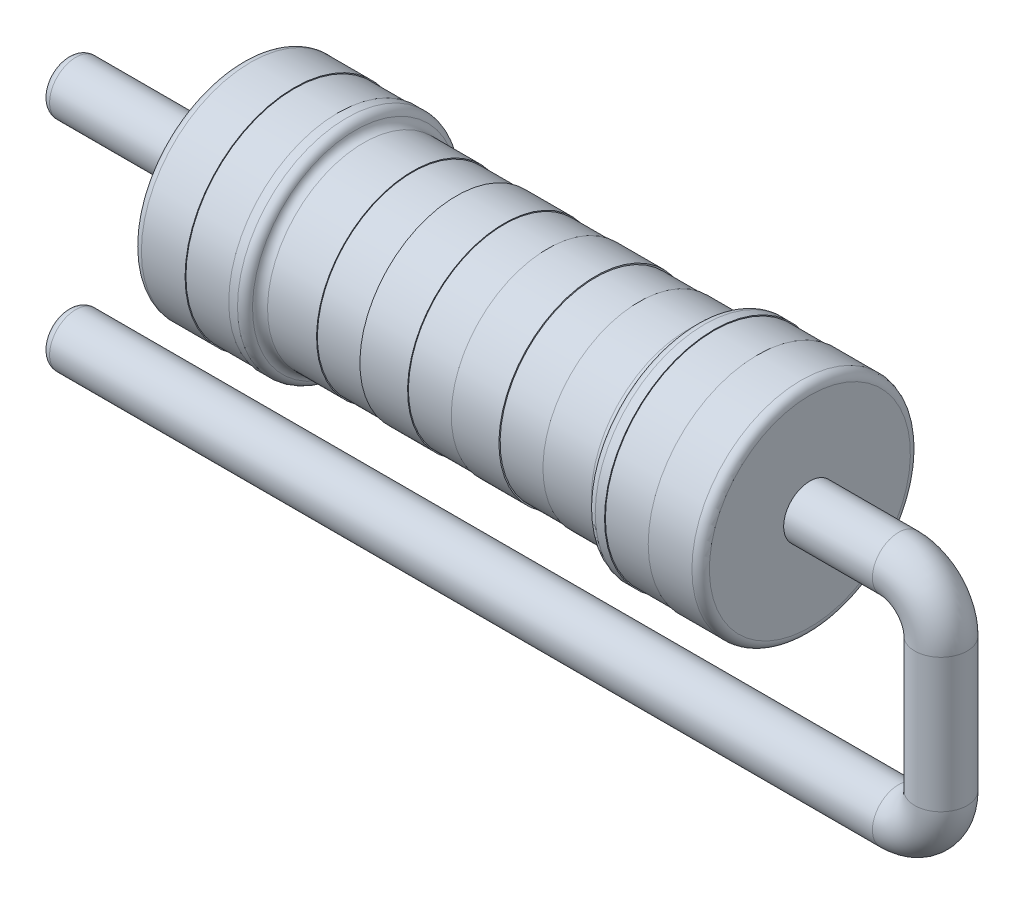
ISO-10303-21;
HEADER;
FILE_DESCRIPTION(('STEP AP214'),'2;1');
FILE_NAME('part.step','',(''),(''),'','','');
FILE_SCHEMA(('AUTOMOTIVE_DESIGN { 1 0 10303 214 1 1 1 1 }'));
ENDSEC;
DATA;
#1=APPLICATION_CONTEXT('core data for automotive mechanical design processes');
#2=APPLICATION_PROTOCOL_DEFINITION('international standard','automotive_design',2000,#1);
#3=PRODUCT_CONTEXT('',#1,'mechanical');
#4=PRODUCT('Part','Part','',(#3));
#5=PRODUCT_RELATED_PRODUCT_CATEGORY('part','',(#4));
#6=PRODUCT_DEFINITION_FORMATION('','',#4);
#7=PRODUCT_DEFINITION_CONTEXT('part definition',#1,'design');
#8=PRODUCT_DEFINITION('design','',#6,#7);
#9=PRODUCT_DEFINITION_SHAPE('','',#8);
#10=(LENGTH_UNIT() NAMED_UNIT(*) SI_UNIT(.MILLI.,.METRE.));
#11=(NAMED_UNIT(*) PLANE_ANGLE_UNIT() SI_UNIT($,.RADIAN.));
#12=(NAMED_UNIT(*) SI_UNIT($,.STERADIAN.) SOLID_ANGLE_UNIT());
#13=UNCERTAINTY_MEASURE_WITH_UNIT(LENGTH_MEASURE(1.E-05),#10,'distance_accuracy_value','');
#14=(GEOMETRIC_REPRESENTATION_CONTEXT(3) GLOBAL_UNCERTAINTY_ASSIGNED_CONTEXT((#13)) GLOBAL_UNIT_ASSIGNED_CONTEXT((#10,
#11,#12)) REPRESENTATION_CONTEXT('',''));
#15=CARTESIAN_POINT('',(0.,0.,0.));
#16=DIRECTION('',(0.,0.,1.));
#17=DIRECTION('',(1.,0.,0.));
#18=AXIS2_PLACEMENT_3D('',#15,#16,#17);
#19=CARTESIAN_POINT('',(3.25,0.,0.));
#20=DIRECTION('',(1.,0.,0.));
#21=DIRECTION('',(0.,1.,0.));
#22=AXIS2_PLACEMENT_3D('',#19,#20,#21);
#23=PLANE('',#22);
#24=CARTESIAN_POINT('',(3.25,0.,0.));
#25=DIRECTION('',(1.,0.,0.));
#26=DIRECTION('',(0.,1.,0.));
#27=AXIS2_PLACEMENT_3D('',#24,#25,#26);
#28=CIRCLE('',#27,0.3);
#29=CARTESIAN_POINT('',(3.25,0.300000000000001,0.));
#30=VERTEX_POINT('',#29);
#31=EDGE_CURVE('E56',#30,#30,#28,.T.);
#32=ORIENTED_EDGE('',*,*,#31,.F.);
#33=EDGE_LOOP('',(#32));
#34=FACE_BOUND('',#33,.T.);
#35=CARTESIAN_POINT('',(3.25,0.,0.));
#36=DIRECTION('',(1.,0.,0.));
#37=DIRECTION('',(0.,1.,0.));
#38=AXIS2_PLACEMENT_3D('',#35,#36,#37);
#39=CIRCLE('',#38,1.15);
#40=CARTESIAN_POINT('',(3.25,1.15,0.));
#41=VERTEX_POINT('',#40);
#42=EDGE_CURVE('E59',#41,#41,#39,.T.);
#43=ORIENTED_EDGE('',*,*,#42,.T.);
#44=EDGE_LOOP('',(#43));
#45=FACE_BOUND('',#44,.T.);
#46=ADVANCED_FACE('F33',(#34,#45),#23,.T.);
#47=CARTESIAN_POINT('',(-3.25,0.,0.));
#48=DIRECTION('',(-1.,0.,0.));
#49=DIRECTION('',(0.,-1.,0.));
#50=AXIS2_PLACEMENT_3D('',#47,#48,#49);
#51=CYLINDRICAL_SURFACE('',#50,1.25);
#52=CARTESIAN_POINT('',(3.15,0.,0.));
#53=DIRECTION('',(1.,0.,0.));
#54=DIRECTION('',(0.,1.,0.));
#55=AXIS2_PLACEMENT_3D('',#52,#53,#54);
#56=CIRCLE('',#55,1.25);
#57=CARTESIAN_POINT('',(3.15,1.25,0.));
#58=VERTEX_POINT('',#57);
#59=EDGE_CURVE('E62',#58,#58,#56,.F.);
#60=ORIENTED_EDGE('',*,*,#59,.T.);
#61=EDGE_LOOP('',(#60));
#62=FACE_BOUND('',#61,.T.);
#63=CARTESIAN_POINT('',(2.65,0.,0.));
#64=DIRECTION('',(-1.,0.,0.));
#65=DIRECTION('',(0.,-1.,0.));
#66=AXIS2_PLACEMENT_3D('',#63,#64,#65);
#67=CIRCLE('',#66,1.25);
#68=CARTESIAN_POINT('',(2.65,-1.25,0.));
#69=VERTEX_POINT('',#68);
#70=EDGE_CURVE('E89',#69,#69,#67,.T.);
#71=ORIENTED_EDGE('',*,*,#70,.F.);
#72=EDGE_LOOP('',(#71));
#73=FACE_BOUND('',#72,.T.);
#74=ADVANCED_FACE('F173',(#62,#73),#51,.T.);
#75=CARTESIAN_POINT('',(2.65,-1.25,0.));
#76=DIRECTION('',(-1.,0.,0.));
#77=DIRECTION('',(0.,-1.,0.));
#78=AXIS2_PLACEMENT_3D('',#75,#76,#77);
#79=PLANE('',#78);
#80=ORIENTED_EDGE('',*,*,#70,.T.);
#81=EDGE_LOOP('',(#80));
#82=FACE_BOUND('',#81,.T.);
#83=CARTESIAN_POINT('',(2.65,0.,0.));
#84=DIRECTION('',(-1.,0.,0.));
#85=DIRECTION('',(0.,-1.,0.));
#86=AXIS2_PLACEMENT_3D('',#83,#84,#85);
#87=CIRCLE('',#86,1.24);
#88=CARTESIAN_POINT('',(2.65,-1.24,0.));
#89=VERTEX_POINT('',#88);
#90=EDGE_CURVE('E92',#89,#89,#87,.T.);
#91=ORIENTED_EDGE('',*,*,#90,.F.);
#92=EDGE_LOOP('',(#91));
#93=FACE_BOUND('',#92,.T.);
#94=ADVANCED_FACE('F187',(#82,#93),#79,.T.);
#95=CARTESIAN_POINT('',(-3.25,0.,0.));
#96=DIRECTION('',(-1.,0.,0.));
#97=DIRECTION('',(0.,-1.,0.));
#98=AXIS2_PLACEMENT_3D('',#95,#96,#97);
#99=CYLINDRICAL_SURFACE('',#98,1.24);
#100=ORIENTED_EDGE('',*,*,#90,.T.);
#101=EDGE_LOOP('',(#100));
#102=FACE_BOUND('',#101,.T.);
#103=CARTESIAN_POINT('',(2.15,0.,0.));
#104=DIRECTION('',(-1.,0.,0.));
#105=DIRECTION('',(0.,-1.,0.));
#106=AXIS2_PLACEMENT_3D('',#103,#104,#105);
#107=CIRCLE('',#106,1.24);
#108=CARTESIAN_POINT('',(2.15,-1.24,0.));
#109=VERTEX_POINT('',#108);
#110=EDGE_CURVE('E95',#109,#109,#107,.T.);
#111=ORIENTED_EDGE('',*,*,#110,.F.);
#112=EDGE_LOOP('',(#111));
#113=FACE_BOUND('',#112,.T.);
#114=ADVANCED_FACE('F193',(#102,#113),#99,.T.);
#115=CARTESIAN_POINT('',(2.15,-1.24,0.));
#116=DIRECTION('',(1.,0.,0.));
#117=DIRECTION('',(0.,1.,0.));
#118=AXIS2_PLACEMENT_3D('',#115,#116,#117);
#119=PLANE('',#118);
#120=ORIENTED_EDGE('',*,*,#110,.T.);
#121=EDGE_LOOP('',(#120));
#122=FACE_BOUND('',#121,.T.);
#123=CARTESIAN_POINT('',(2.15,0.,0.));
#124=DIRECTION('',(-1.,0.,0.));
#125=DIRECTION('',(0.,-1.,0.));
#126=AXIS2_PLACEMENT_3D('',#123,#124,#125);
#127=CIRCLE('',#126,1.25);
#128=CARTESIAN_POINT('',(2.15,-1.25,0.));
#129=VERTEX_POINT('',#128);
#130=EDGE_CURVE('E98',#129,#129,#127,.T.);
#131=ORIENTED_EDGE('',*,*,#130,.F.);
#132=EDGE_LOOP('',(#131));
#133=FACE_BOUND('',#132,.T.);
#134=ADVANCED_FACE('F199',(#122,#133),#119,.T.);
#135=CARTESIAN_POINT('',(-3.25,0.,0.));
#136=DIRECTION('',(-1.,0.,0.));
#137=DIRECTION('',(0.,-1.,0.));
#138=AXIS2_PLACEMENT_3D('',#135,#136,#137);
#139=CYLINDRICAL_SURFACE('',#138,1.25);
#140=CARTESIAN_POINT('',(2.0436491673104,0.,0.));
#141=DIRECTION('',(1.,0.,0.));
#142=DIRECTION('',(0.,1.,0.));
#143=AXIS2_PLACEMENT_3D('',#140,#141,#142);
#144=CIRCLE('',#143,1.25);
#145=CARTESIAN_POINT('',(2.0436491673104,1.25,0.));
#146=VERTEX_POINT('',#145);
#147=EDGE_CURVE('E71',#146,#146,#144,.T.);
#148=ORIENTED_EDGE('',*,*,#147,.T.);
#149=EDGE_LOOP('',(#148));
#150=FACE_BOUND('',#149,.T.);
#151=ORIENTED_EDGE('',*,*,#130,.T.);
#152=EDGE_LOOP('',(#151));
#153=FACE_BOUND('',#152,.T.);
#154=ADVANCED_FACE('F205',(#150,#153),#139,.T.);
#155=CARTESIAN_POINT('',(-3.25,0.,0.));
#156=DIRECTION('',(-1.,0.,0.));
#157=DIRECTION('',(0.,-1.,0.));
#158=AXIS2_PLACEMENT_3D('',#155,#156,#157);
#159=CYLINDRICAL_SURFACE('',#158,1.1);
#160=CARTESIAN_POINT('',(1.85,0.,0.));
#161=DIRECTION('',(-1.,0.,0.));
#162=DIRECTION('',(0.,-1.,0.));
#163=AXIS2_PLACEMENT_3D('',#160,#161,#162);
#164=CIRCLE('',#163,1.1);
#165=CARTESIAN_POINT('',(1.85,-1.1,0.));
#166=VERTEX_POINT('',#165);
#167=EDGE_CURVE('E86',#166,#166,#164,.T.);
#168=ORIENTED_EDGE('',*,*,#167,.T.);
#169=EDGE_LOOP('',(#168));
#170=FACE_BOUND('',#169,.T.);
#171=CARTESIAN_POINT('',(1.29552343653446,0.,0.));
#172=DIRECTION('',(-1.,0.,0.));
#173=DIRECTION('',(0.,-1.,0.));
#174=AXIS2_PLACEMENT_3D('',#171,#172,#173);
#175=CIRCLE('',#174,1.1);
#176=CARTESIAN_POINT('',(1.29552343653446,-1.1,0.));
#177=VERTEX_POINT('',#176);
#178=EDGE_CURVE('E101',#177,#177,#175,.T.);
#179=ORIENTED_EDGE('',*,*,#178,.F.);
#180=EDGE_LOOP('',(#179));
#181=FACE_BOUND('',#180,.T.);
#182=ADVANCED_FACE('F210',(#170,#181),#159,.T.);
#183=CARTESIAN_POINT('',(1.29552343653446,-1.1,0.));
#184=DIRECTION('',(-1.,0.,0.));
#185=DIRECTION('',(0.,-1.,0.));
#186=AXIS2_PLACEMENT_3D('',#183,#184,#185);
#187=PLANE('',#186);
#188=ORIENTED_EDGE('',*,*,#178,.T.);
#189=EDGE_LOOP('',(#188));
#190=FACE_BOUND('',#189,.T.);
#191=CARTESIAN_POINT('',(1.29552343653446,0.,0.));
#192=DIRECTION('',(-1.,0.,0.));
#193=DIRECTION('',(0.,-1.,0.));
#194=AXIS2_PLACEMENT_3D('',#191,#192,#193);
#195=CIRCLE('',#194,1.09);
#196=CARTESIAN_POINT('',(1.29552343653446,-1.09,0.));
#197=VERTEX_POINT('',#196);
#198=EDGE_CURVE('E104',#197,#197,#195,.T.);
#199=ORIENTED_EDGE('',*,*,#198,.F.);
#200=EDGE_LOOP('',(#199));
#201=FACE_BOUND('',#200,.T.);
#202=ADVANCED_FACE('F216',(#190,#201),#187,.T.);
#203=CARTESIAN_POINT('',(-3.25,0.,0.));
#204=DIRECTION('',(-1.,0.,0.));
#205=DIRECTION('',(0.,-1.,0.));
#206=AXIS2_PLACEMENT_3D('',#203,#204,#205);
#207=CYLINDRICAL_SURFACE('',#206,1.09);
#208=ORIENTED_EDGE('',*,*,#198,.T.);
#209=EDGE_LOOP('',(#208));
#210=FACE_BOUND('',#209,.T.);
#211=CARTESIAN_POINT('',(0.795523436534458,0.,0.));
#212=DIRECTION('',(-1.,0.,0.));
#213=DIRECTION('',(0.,-1.,0.));
#214=AXIS2_PLACEMENT_3D('',#211,#212,#213);
#215=CIRCLE('',#214,1.09);
#216=CARTESIAN_POINT('',(0.795523436534458,-1.09,0.));
#217=VERTEX_POINT('',#216);
#218=EDGE_CURVE('E107',#217,#217,#215,.T.);
#219=ORIENTED_EDGE('',*,*,#218,.F.);
#220=EDGE_LOOP('',(#219));
#221=FACE_BOUND('',#220,.T.);
#222=ADVANCED_FACE('F337',(#210,#221),#207,.T.);
#223=CARTESIAN_POINT('',(0.795523436534458,-1.09,0.));
#224=DIRECTION('',(1.,0.,0.));
#225=DIRECTION('',(0.,1.,0.));
#226=AXIS2_PLACEMENT_3D('',#223,#224,#225);
#227=PLANE('',#226);
#228=ORIENTED_EDGE('',*,*,#218,.T.);
#229=EDGE_LOOP('',(#228));
#230=FACE_BOUND('',#229,.T.);
#231=CARTESIAN_POINT('',(0.795523436534458,0.,0.));
#232=DIRECTION('',(-1.,0.,0.));
#233=DIRECTION('',(0.,-1.,0.));
#234=AXIS2_PLACEMENT_3D('',#231,#232,#233);
#235=CIRCLE('',#234,1.10375370034682);
#236=CARTESIAN_POINT('',(0.795523436534458,-1.10375370034682,0.));
#237=VERTEX_POINT('',#236);
#238=EDGE_CURVE('E110',#237,#237,#235,.T.);
#239=ORIENTED_EDGE('',*,*,#238,.F.);
#240=EDGE_LOOP('',(#239));
#241=FACE_BOUND('',#240,.T.);
#242=ADVANCED_FACE('F333',(#230,#241),#227,.T.);
#243=CARTESIAN_POINT('',(-3.25,0.,0.));
#244=DIRECTION('',(-1.,0.,0.));
#245=DIRECTION('',(0.,-1.,0.));
#246=AXIS2_PLACEMENT_3D('',#243,#244,#245);
#247=CYLINDRICAL_SURFACE('',#246,1.10375370034682);
#248=ORIENTED_EDGE('',*,*,#238,.T.);
#249=EDGE_LOOP('',(#248));
#250=FACE_BOUND('',#249,.T.);
#251=CARTESIAN_POINT('',(0.25,0.,0.));
#252=DIRECTION('',(-1.,0.,0.));
#253=DIRECTION('',(0.,-1.,0.));
#254=AXIS2_PLACEMENT_3D('',#251,#252,#253);
#255=CIRCLE('',#254,1.10375370034682);
#256=CARTESIAN_POINT('',(0.25,-1.10375370034682,0.));
#257=VERTEX_POINT('',#256);
#258=EDGE_CURVE('E113',#257,#257,#255,.T.);
#259=ORIENTED_EDGE('',*,*,#258,.F.);
#260=EDGE_LOOP('',(#259));
#261=FACE_BOUND('',#260,.T.);
#262=ADVANCED_FACE('F329',(#250,#261),#247,.T.);
#263=CARTESIAN_POINT('',(0.25,-1.10375370034682,0.));
#264=DIRECTION('',(-1.,0.,0.));
#265=DIRECTION('',(0.,-1.,0.));
#266=AXIS2_PLACEMENT_3D('',#263,#264,#265);
#267=PLANE('',#266);
#268=ORIENTED_EDGE('',*,*,#258,.T.);
#269=EDGE_LOOP('',(#268));
#270=FACE_BOUND('',#269,.T.);
#271=CARTESIAN_POINT('',(0.25,0.,0.));
#272=DIRECTION('',(-1.,0.,0.));
#273=DIRECTION('',(0.,-1.,0.));
#274=AXIS2_PLACEMENT_3D('',#271,#272,#273);
#275=CIRCLE('',#274,1.09375370034682);
#276=CARTESIAN_POINT('',(0.25,-1.09375370034682,0.));
#277=VERTEX_POINT('',#276);
#278=EDGE_CURVE('E116',#277,#277,#275,.T.);
#279=ORIENTED_EDGE('',*,*,#278,.F.);
#280=EDGE_LOOP('',(#279));
#281=FACE_BOUND('',#280,.T.);
#282=ADVANCED_FACE('F325',(#270,#281),#267,.T.);
#283=CARTESIAN_POINT('',(-3.25,0.,0.));
#284=DIRECTION('',(-1.,0.,0.));
#285=DIRECTION('',(0.,-1.,0.));
#286=AXIS2_PLACEMENT_3D('',#283,#284,#285);
#287=CYLINDRICAL_SURFACE('',#286,1.09375370034682);
#288=ORIENTED_EDGE('',*,*,#278,.T.);
#289=EDGE_LOOP('',(#288));
#290=FACE_BOUND('',#289,.T.);
#291=CARTESIAN_POINT('',(-0.25,0.,0.));
#292=DIRECTION('',(-1.,0.,0.));
#293=DIRECTION('',(0.,-1.,0.));
#294=AXIS2_PLACEMENT_3D('',#291,#292,#293);
#295=CIRCLE('',#294,1.09375370034682);
#296=CARTESIAN_POINT('',(-0.25,-1.09375370034682,0.));
#297=VERTEX_POINT('',#296);
#298=EDGE_CURVE('E119',#297,#297,#295,.T.);
#299=ORIENTED_EDGE('',*,*,#298,.F.);
#300=EDGE_LOOP('',(#299));
#301=FACE_BOUND('',#300,.T.);
#302=ADVANCED_FACE('F321',(#290,#301),#287,.T.);
#303=CARTESIAN_POINT('',(-0.25,-1.10375370034682,0.));
#304=DIRECTION('',(1.,0.,0.));
#305=DIRECTION('',(0.,1.,0.));
#306=AXIS2_PLACEMENT_3D('',#303,#304,#305);
#307=PLANE('',#306);
#308=ORIENTED_EDGE('',*,*,#298,.T.);
#309=EDGE_LOOP('',(#308));
#310=FACE_BOUND('',#309,.T.);
#311=CARTESIAN_POINT('',(-0.25,0.,0.));
#312=DIRECTION('',(-1.,0.,0.));
#313=DIRECTION('',(0.,-1.,0.));
#314=AXIS2_PLACEMENT_3D('',#311,#312,#313);
#315=CIRCLE('',#314,1.10375370034682);
#316=CARTESIAN_POINT('',(-0.25,-1.10375370034682,0.));
#317=VERTEX_POINT('',#316);
#318=EDGE_CURVE('E122',#317,#317,#315,.T.);
#319=ORIENTED_EDGE('',*,*,#318,.F.);
#320=EDGE_LOOP('',(#319));
#321=FACE_BOUND('',#320,.T.);
#322=ADVANCED_FACE('F317',(#310,#321),#307,.T.);
#323=CARTESIAN_POINT('',(-3.25,0.,0.));
#324=DIRECTION('',(-1.,0.,0.));
#325=DIRECTION('',(0.,-1.,0.));
#326=AXIS2_PLACEMENT_3D('',#323,#324,#325);
#327=CYLINDRICAL_SURFACE('',#326,1.10375370034682);
#328=ORIENTED_EDGE('',*,*,#318,.T.);
#329=EDGE_LOOP('',(#328));
#330=FACE_BOUND('',#329,.T.);
#331=CARTESIAN_POINT('',(-0.795523436534458,0.,0.));
#332=DIRECTION('',(-1.,0.,0.));
#333=DIRECTION('',(0.,-1.,0.));
#334=AXIS2_PLACEMENT_3D('',#331,#332,#333);
#335=CIRCLE('',#334,1.10375370034682);
#336=CARTESIAN_POINT('',(-0.795523436534457,-1.10375370034682,0.));
#337=VERTEX_POINT('',#336);
#338=EDGE_CURVE('E125',#337,#337,#335,.T.);
#339=ORIENTED_EDGE('',*,*,#338,.F.);
#340=EDGE_LOOP('',(#339));
#341=FACE_BOUND('',#340,.T.);
#342=ADVANCED_FACE('F313',(#330,#341),#327,.T.);
#343=CARTESIAN_POINT('',(-0.795523436534457,-1.09,0.));
#344=DIRECTION('',(-1.,0.,0.));
#345=DIRECTION('',(0.,-1.,0.));
#346=AXIS2_PLACEMENT_3D('',#343,#344,#345);
#347=PLANE('',#346);
#348=ORIENTED_EDGE('',*,*,#338,.T.);
#349=EDGE_LOOP('',(#348));
#350=FACE_BOUND('',#349,.T.);
#351=CARTESIAN_POINT('',(-0.795523436534458,0.,0.));
#352=DIRECTION('',(-1.,0.,0.));
#353=DIRECTION('',(0.,-1.,0.));
#354=AXIS2_PLACEMENT_3D('',#351,#352,#353);
#355=CIRCLE('',#354,1.09);
#356=CARTESIAN_POINT('',(-0.795523436534457,-1.09,0.));
#357=VERTEX_POINT('',#356);
#358=EDGE_CURVE('E128',#357,#357,#355,.T.);
#359=ORIENTED_EDGE('',*,*,#358,.F.);
#360=EDGE_LOOP('',(#359));
#361=FACE_BOUND('',#360,.T.);
#362=ADVANCED_FACE('F309',(#350,#361),#347,.T.);
#363=CARTESIAN_POINT('',(-3.25,0.,0.));
#364=DIRECTION('',(-1.,0.,0.));
#365=DIRECTION('',(0.,-1.,0.));
#366=AXIS2_PLACEMENT_3D('',#363,#364,#365);
#367=CYLINDRICAL_SURFACE('',#366,1.09);
#368=ORIENTED_EDGE('',*,*,#358,.T.);
#369=EDGE_LOOP('',(#368));
#370=FACE_BOUND('',#369,.T.);
#371=CARTESIAN_POINT('',(-1.29552343653446,0.,0.));
#372=DIRECTION('',(-1.,0.,0.));
#373=DIRECTION('',(0.,-1.,0.));
#374=AXIS2_PLACEMENT_3D('',#371,#372,#373);
#375=CIRCLE('',#374,1.09);
#376=CARTESIAN_POINT('',(-1.29552343653446,-1.09,0.));
#377=VERTEX_POINT('',#376);
#378=EDGE_CURVE('E131',#377,#377,#375,.T.);
#379=ORIENTED_EDGE('',*,*,#378,.F.);
#380=EDGE_LOOP('',(#379));
#381=FACE_BOUND('',#380,.T.);
#382=ADVANCED_FACE('F305',(#370,#381),#367,.T.);
#383=CARTESIAN_POINT('',(-1.29552343653446,-1.1,0.));
#384=DIRECTION('',(1.,0.,0.));
#385=DIRECTION('',(0.,1.,0.));
#386=AXIS2_PLACEMENT_3D('',#383,#384,#385);
#387=PLANE('',#386);
#388=ORIENTED_EDGE('',*,*,#378,.T.);
#389=EDGE_LOOP('',(#388));
#390=FACE_BOUND('',#389,.T.);
#391=CARTESIAN_POINT('',(-1.29552343653446,0.,0.));
#392=DIRECTION('',(-1.,0.,0.));
#393=DIRECTION('',(0.,-1.,0.));
#394=AXIS2_PLACEMENT_3D('',#391,#392,#393);
#395=CIRCLE('',#394,1.1);
#396=CARTESIAN_POINT('',(-1.29552343653446,-1.1,0.));
#397=VERTEX_POINT('',#396);
#398=EDGE_CURVE('E134',#397,#397,#395,.T.);
#399=ORIENTED_EDGE('',*,*,#398,.F.);
#400=EDGE_LOOP('',(#399));
#401=FACE_BOUND('',#400,.T.);
#402=ADVANCED_FACE('F301',(#390,#401),#387,.T.);
#403=CARTESIAN_POINT('',(-3.25,0.,0.));
#404=DIRECTION('',(-1.,0.,0.));
#405=DIRECTION('',(0.,-1.,0.));
#406=AXIS2_PLACEMENT_3D('',#403,#404,#405);
#407=CYLINDRICAL_SURFACE('',#406,1.1);
#408=CARTESIAN_POINT('',(-1.85635083268958,0.,0.));
#409=DIRECTION('',(-1.,0.,0.));
#410=DIRECTION('',(0.,-1.,0.));
#411=AXIS2_PLACEMENT_3D('',#408,#409,#410);
#412=CIRCLE('',#411,1.1);
#413=CARTESIAN_POINT('',(-1.85635083268958,-1.1,0.));
#414=VERTEX_POINT('',#413);
#415=EDGE_CURVE('E65',#414,#414,#412,.F.);
#416=ORIENTED_EDGE('',*,*,#415,.T.);
#417=EDGE_LOOP('',(#416));
#418=FACE_BOUND('',#417,.T.);
#419=ORIENTED_EDGE('',*,*,#398,.T.);
#420=EDGE_LOOP('',(#419));
#421=FACE_BOUND('',#420,.T.);
#422=ADVANCED_FACE('F297',(#418,#421),#407,.T.);
#423=CARTESIAN_POINT('',(-3.25,0.,0.));
#424=DIRECTION('',(-1.,0.,0.));
#425=DIRECTION('',(0.,-1.,0.));
#426=AXIS2_PLACEMENT_3D('',#423,#424,#425);
#427=CYLINDRICAL_SURFACE('',#426,1.25);
#428=CARTESIAN_POINT('',(-2.05,0.,0.));
#429=DIRECTION('',(1.,0.,0.));
#430=DIRECTION('',(0.,1.,0.));
#431=AXIS2_PLACEMENT_3D('',#428,#429,#430);
#432=CIRCLE('',#431,1.25);
#433=CARTESIAN_POINT('',(-2.05,1.25,0.));
#434=VERTEX_POINT('',#433);
#435=EDGE_CURVE('E77',#434,#434,#432,.F.);
#436=ORIENTED_EDGE('',*,*,#435,.T.);
#437=EDGE_LOOP('',(#436));
#438=FACE_BOUND('',#437,.T.);
#439=CARTESIAN_POINT('',(-2.15,0.,0.));
#440=DIRECTION('',(-1.,0.,0.));
#441=DIRECTION('',(0.,-1.,0.));
#442=AXIS2_PLACEMENT_3D('',#439,#440,#441);
#443=CIRCLE('',#442,1.25);
#444=CARTESIAN_POINT('',(-2.15,-1.25,0.));
#445=VERTEX_POINT('',#444);
#446=EDGE_CURVE('E137',#445,#445,#443,.T.);
#447=ORIENTED_EDGE('',*,*,#446,.F.);
#448=EDGE_LOOP('',(#447));
#449=FACE_BOUND('',#448,.T.);
#450=ADVANCED_FACE('F293',(#438,#449),#427,.T.);
#451=CARTESIAN_POINT('',(-2.15,-1.24,0.));
#452=DIRECTION('',(-1.,0.,0.));
#453=DIRECTION('',(0.,-1.,0.));
#454=AXIS2_PLACEMENT_3D('',#451,#452,#453);
#455=PLANE('',#454);
#456=ORIENTED_EDGE('',*,*,#446,.T.);
#457=EDGE_LOOP('',(#456));
#458=FACE_BOUND('',#457,.T.);
#459=CARTESIAN_POINT('',(-2.15,0.,0.));
#460=DIRECTION('',(-1.,0.,0.));
#461=DIRECTION('',(0.,-1.,0.));
#462=AXIS2_PLACEMENT_3D('',#459,#460,#461);
#463=CIRCLE('',#462,1.24);
#464=CARTESIAN_POINT('',(-2.15,-1.24,0.));
#465=VERTEX_POINT('',#464);
#466=EDGE_CURVE('E140',#465,#465,#463,.T.);
#467=ORIENTED_EDGE('',*,*,#466,.F.);
#468=EDGE_LOOP('',(#467));
#469=FACE_BOUND('',#468,.T.);
#470=ADVANCED_FACE('F289',(#458,#469),#455,.T.);
#471=CARTESIAN_POINT('',(-3.25,0.,0.));
#472=DIRECTION('',(-1.,0.,0.));
#473=DIRECTION('',(0.,-1.,0.));
#474=AXIS2_PLACEMENT_3D('',#471,#472,#473);
#475=CYLINDRICAL_SURFACE('',#474,1.24);
#476=ORIENTED_EDGE('',*,*,#466,.T.);
#477=EDGE_LOOP('',(#476));
#478=FACE_BOUND('',#477,.T.);
#479=CARTESIAN_POINT('',(-2.65,0.,0.));
#480=DIRECTION('',(-1.,0.,0.));
#481=DIRECTION('',(0.,-1.,0.));
#482=AXIS2_PLACEMENT_3D('',#479,#480,#481);
#483=CIRCLE('',#482,1.24);
#484=CARTESIAN_POINT('',(-2.65,-1.24,0.));
#485=VERTEX_POINT('',#484);
#486=EDGE_CURVE('E143',#485,#485,#483,.T.);
#487=ORIENTED_EDGE('',*,*,#486,.F.);
#488=EDGE_LOOP('',(#487));
#489=FACE_BOUND('',#488,.T.);
#490=ADVANCED_FACE('F285',(#478,#489),#475,.T.);
#491=CARTESIAN_POINT('',(-2.65,-1.25,0.));
#492=DIRECTION('',(1.,0.,0.));
#493=DIRECTION('',(0.,1.,0.));
#494=AXIS2_PLACEMENT_3D('',#491,#492,#493);
#495=PLANE('',#494);
#496=ORIENTED_EDGE('',*,*,#486,.T.);
#497=EDGE_LOOP('',(#496));
#498=FACE_BOUND('',#497,.T.);
#499=CARTESIAN_POINT('',(-2.65,0.,0.));
#500=DIRECTION('',(-1.,0.,0.));
#501=DIRECTION('',(0.,-1.,0.));
#502=AXIS2_PLACEMENT_3D('',#499,#500,#501);
#503=CIRCLE('',#502,1.25);
#504=CARTESIAN_POINT('',(-2.65,-1.25,0.));
#505=VERTEX_POINT('',#504);
#506=EDGE_CURVE('E146',#505,#505,#503,.T.);
#507=ORIENTED_EDGE('',*,*,#506,.F.);
#508=EDGE_LOOP('',(#507));
#509=FACE_BOUND('',#508,.T.);
#510=ADVANCED_FACE('F281',(#498,#509),#495,.T.);
#511=CARTESIAN_POINT('',(-3.25,0.,0.));
#512=DIRECTION('',(-1.,0.,0.));
#513=DIRECTION('',(0.,-1.,0.));
#514=AXIS2_PLACEMENT_3D('',#511,#512,#513);
#515=CYLINDRICAL_SURFACE('',#514,1.25);
#516=CARTESIAN_POINT('',(-3.15,0.,0.));
#517=DIRECTION('',(-1.,0.,0.));
#518=DIRECTION('',(0.,-1.,0.));
#519=AXIS2_PLACEMENT_3D('',#516,#517,#518);
#520=CIRCLE('',#519,1.25);
#521=CARTESIAN_POINT('',(-3.15,-1.25,0.));
#522=VERTEX_POINT('',#521);
#523=EDGE_CURVE('E80',#522,#522,#520,.F.);
#524=ORIENTED_EDGE('',*,*,#523,.T.);
#525=EDGE_LOOP('',(#524));
#526=FACE_BOUND('',#525,.T.);
#527=ORIENTED_EDGE('',*,*,#506,.T.);
#528=EDGE_LOOP('',(#527));
#529=FACE_BOUND('',#528,.T.);
#530=ADVANCED_FACE('F277',(#526,#529),#515,.T.);
#531=CARTESIAN_POINT('',(-3.25,0.,0.));
#532=DIRECTION('',(-1.,0.,0.));
#533=DIRECTION('',(0.,-1.,0.));
#534=AXIS2_PLACEMENT_3D('',#531,#532,#533);
#535=PLANE('',#534);
#536=CARTESIAN_POINT('',(-3.25,0.,0.));
#537=DIRECTION('',(-1.,0.,0.));
#538=DIRECTION('',(0.,-1.,0.));
#539=AXIS2_PLACEMENT_3D('',#536,#537,#538);
#540=CIRCLE('',#539,0.3);
#541=CARTESIAN_POINT('',(-3.25,-0.300000000000001,0.));
#542=VERTEX_POINT('',#541);
#543=EDGE_CURVE('E53',#542,#542,#540,.T.);
#544=ORIENTED_EDGE('',*,*,#543,.F.);
#545=EDGE_LOOP('',(#544));
#546=FACE_BOUND('',#545,.T.);
#547=CARTESIAN_POINT('',(-3.25,0.,0.));
#548=DIRECTION('',(-1.,0.,0.));
#549=DIRECTION('',(0.,-1.,0.));
#550=AXIS2_PLACEMENT_3D('',#547,#548,#549);
#551=CIRCLE('',#550,1.15);
#552=CARTESIAN_POINT('',(-3.25,-1.15,0.));
#553=VERTEX_POINT('',#552);
#554=EDGE_CURVE('E83',#553,#553,#551,.T.);
#555=ORIENTED_EDGE('',*,*,#554,.T.);
#556=EDGE_LOOP('',(#555));
#557=FACE_BOUND('',#556,.T.);
#558=ADVANCED_FACE('F225',(#546,#557),#535,.T.);
#559=CARTESIAN_POINT('',(1.85,0.,0.));
#560=DIRECTION('',(-1.,0.,0.));
#561=DIRECTION('',(0.,-1.,0.));
#562=AXIS2_PLACEMENT_3D('',#559,#560,#561);
#563=TOROIDAL_SURFACE('',#562,1.2,0.1);
#564=CARTESIAN_POINT('',(1.94682458365521,0.,0.));
#565=DIRECTION('',(-1.,0.,0.));
#566=DIRECTION('',(0.,-1.,0.));
#567=AXIS2_PLACEMENT_3D('',#564,#565,#566);
#568=CIRCLE('',#567,1.175);
#569=CARTESIAN_POINT('',(1.94682458365521,-1.175,0.));
#570=VERTEX_POINT('',#569);
#571=EDGE_CURVE('E74',#570,#570,#568,.T.);
#572=ORIENTED_EDGE('',*,*,#571,.T.);
#573=EDGE_LOOP('',(#572));
#574=FACE_BOUND('',#573,.T.);
#575=ORIENTED_EDGE('',*,*,#167,.F.);
#576=EDGE_LOOP('',(#575));
#577=FACE_BOUND('',#576,.T.);
#578=ADVANCED_FACE('F221',(#574,#577),#563,.F.);
#579=CARTESIAN_POINT('',(-3.15,0.,0.));
#580=DIRECTION('',(-1.,0.,0.));
#581=DIRECTION('',(0.,-1.,0.));
#582=AXIS2_PLACEMENT_3D('',#579,#580,#581);
#583=TOROIDAL_SURFACE('',#582,1.15,0.1);
#584=ORIENTED_EDGE('',*,*,#523,.F.);
#585=EDGE_LOOP('',(#584));
#586=FACE_BOUND('',#585,.T.);
#587=ORIENTED_EDGE('',*,*,#554,.F.);
#588=EDGE_LOOP('',(#587));
#589=FACE_BOUND('',#588,.T.);
#590=ADVANCED_FACE('F224',(#586,#589),#583,.T.);
#591=CARTESIAN_POINT('',(-2.05,0.,0.));
#592=DIRECTION('',(1.,0.,0.));
#593=DIRECTION('',(0.,1.,0.));
#594=AXIS2_PLACEMENT_3D('',#591,#592,#593);
#595=TOROIDAL_SURFACE('',#594,1.15,0.1);
#596=CARTESIAN_POINT('',(-1.95317541634478,0.,0.));
#597=DIRECTION('',(-1.,0.,0.));
#598=DIRECTION('',(0.,-1.,0.));
#599=AXIS2_PLACEMENT_3D('',#596,#597,#598);
#600=CIRCLE('',#599,1.175);
#601=CARTESIAN_POINT('',(-1.95317541634478,-1.175,0.));
#602=VERTEX_POINT('',#601);
#603=EDGE_CURVE('E68',#602,#602,#600,.T.);
#604=ORIENTED_EDGE('',*,*,#603,.T.);
#605=EDGE_LOOP('',(#604));
#606=FACE_BOUND('',#605,.T.);
#607=ORIENTED_EDGE('',*,*,#435,.F.);
#608=EDGE_LOOP('',(#607));
#609=FACE_BOUND('',#608,.T.);
#610=ADVANCED_FACE('F229',(#606,#609),#595,.T.);
#611=CARTESIAN_POINT('',(2.0436491673104,0.,0.));
#612=DIRECTION('',(1.,0.,0.));
#613=DIRECTION('',(0.,1.,0.));
#614=AXIS2_PLACEMENT_3D('',#611,#612,#613);
#615=TOROIDAL_SURFACE('',#614,1.15000000000001,0.1);
#616=ORIENTED_EDGE('',*,*,#147,.F.);
#617=EDGE_LOOP('',(#616));
#618=FACE_BOUND('',#617,.T.);
#619=ORIENTED_EDGE('',*,*,#571,.F.);
#620=EDGE_LOOP('',(#619));
#621=FACE_BOUND('',#620,.T.);
#622=ADVANCED_FACE('F233',(#618,#621),#615,.T.);
#623=CARTESIAN_POINT('',(-1.85635083268958,0.,0.));
#624=DIRECTION('',(-1.,0.,0.));
#625=DIRECTION('',(0.,-1.,0.));
#626=AXIS2_PLACEMENT_3D('',#623,#624,#625);
#627=TOROIDAL_SURFACE('',#626,1.19999999999999,0.1);
#628=ORIENTED_EDGE('',*,*,#415,.F.);
#629=EDGE_LOOP('',(#628));
#630=FACE_BOUND('',#629,.T.);
#631=ORIENTED_EDGE('',*,*,#603,.F.);
#632=EDGE_LOOP('',(#631));
#633=FACE_BOUND('',#632,.T.);
#634=ADVANCED_FACE('F180',(#630,#633),#627,.F.);
#635=CARTESIAN_POINT('',(3.15,0.,0.));
#636=DIRECTION('',(1.,0.,0.));
#637=DIRECTION('',(0.,1.,0.));
#638=AXIS2_PLACEMENT_3D('',#635,#636,#637);
#639=TOROIDAL_SURFACE('',#638,1.15,0.1);
#640=ORIENTED_EDGE('',*,*,#42,.F.);
#641=EDGE_LOOP('',(#640));
#642=FACE_BOUND('',#641,.T.);
#643=ORIENTED_EDGE('',*,*,#59,.F.);
#644=EDGE_LOOP('',(#643));
#645=FACE_BOUND('',#644,.T.);
#646=ADVANCED_FACE('F177',(#642,#645),#639,.T.);
#647=CARTESIAN_POINT('',(-5.25,-2.5,0.));
#648=DIRECTION('',(-1.,0.,0.));
#649=DIRECTION('',(0.,-1.,0.));
#650=AXIS2_PLACEMENT_3D('',#647,#648,#649);
#651=PLANE('',#650);
#652=CARTESIAN_POINT('',(-5.25,-2.5,0.));
#653=DIRECTION('',(-1.,0.,0.));
#654=DIRECTION('',(0.,-1.,0.));
#655=AXIS2_PLACEMENT_3D('',#652,#653,#654);
#656=CIRCLE('',#655,0.2);
#657=CARTESIAN_POINT('',(-5.25,-2.7,0.));
#658=VERTEX_POINT('',#657);
#659=EDGE_CURVE('E48',#658,#658,#656,.T.);
#660=ORIENTED_EDGE('',*,*,#659,.T.);
#661=EDGE_LOOP('',(#660));
#662=FACE_BOUND('',#661,.T.);
#663=ADVANCED_FACE('F167',(#662),#651,.T.);
#664=CARTESIAN_POINT('',(3.25,0.,0.));
#665=DIRECTION('',(1.,0.,0.));
#666=DIRECTION('',(0.,1.,0.));
#667=AXIS2_PLACEMENT_3D('',#664,#665,#666);
#668=CYLINDRICAL_SURFACE('',#667,0.3);
#669=CARTESIAN_POINT('',(4.26558707681336,0.,0.));
#670=DIRECTION('',(1.,0.,0.));
#671=DIRECTION('',(0.,1.,0.));
#672=AXIS2_PLACEMENT_3D('',#669,#670,#671);
#673=CIRCLE('',#672,0.3);
#674=CARTESIAN_POINT('',(4.26558707681336,0.299999999999998,0.));
#675=VERTEX_POINT('',#674);
#676=EDGE_CURVE('E158',#675,#675,#673,.T.);
#677=ORIENTED_EDGE('',*,*,#676,.F.);
#678=EDGE_LOOP('',(#677));
#679=FACE_BOUND('',#678,.T.);
#680=ORIENTED_EDGE('',*,*,#31,.T.);
#681=EDGE_LOOP('',(#680));
#682=FACE_BOUND('',#681,.T.);
#683=ADVANCED_FACE('F164',(#679,#682),#668,.T.);
#684=CARTESIAN_POINT('',(4.26558707681336,-0.484412923186644,0.));
#685=DIRECTION('',(0.,0.,-1.));
#686=DIRECTION('',(-1.,0.,0.));
#687=AXIS2_PLACEMENT_3D('',#684,#685,#686);
#688=TOROIDAL_SURFACE('',#687,0.484412923186643,0.3);
#689=CARTESIAN_POINT('',(4.75,-0.484412923186644,0.));
#690=DIRECTION('',(0.,-1.,0.));
#691=DIRECTION('',(1.,0.,0.));
#692=AXIS2_PLACEMENT_3D('',#689,#690,#691);
#693=CIRCLE('',#692,0.3);
#694=CARTESIAN_POINT('',(5.05,-0.484412923186644,0.));
#695=VERTEX_POINT('',#694);
#696=EDGE_CURVE('E155',#695,#695,#693,.T.);
#697=CARTESIAN_POINT('',(4.26558707681336,-0.484412923186644,0.));
#698=DIRECTION('',(0.,0.,-1.));
#699=DIRECTION('',(-1.,0.,0.));
#700=AXIS2_PLACEMENT_3D('',#697,#698,#699);
#701=CIRCLE('',#700,0.784412923186643);
#702=EDGE_CURVE('',#675,#695,#701,.T.);
#703=ORIENTED_EDGE('',*,*,#676,.T.);
#704=ORIENTED_EDGE('',*,*,#696,.F.);
#705=ORIENTED_EDGE('',*,*,#702,.T.);
#706=ORIENTED_EDGE('',*,*,#702,.F.);
#707=EDGE_LOOP('',(#703,#705,#704,#706));
#708=FACE_BOUND('',#707,.T.);
#709=ADVANCED_FACE('F162',(#708),#688,.T.);
#710=CARTESIAN_POINT('',(4.75,-0.484412923186644,0.));
#711=DIRECTION('',(0.,-1.,0.));
#712=DIRECTION('',(0.,0.,-1.));
#713=AXIS2_PLACEMENT_3D('',#710,#711,#712);
#714=CYLINDRICAL_SURFACE('',#713,0.3);
#715=CARTESIAN_POINT('',(4.75,-2.01558707681336,0.));
#716=DIRECTION('',(0.,-1.,0.));
#717=DIRECTION('',(1.,0.,0.));
#718=AXIS2_PLACEMENT_3D('',#715,#716,#717);
#719=CIRCLE('',#718,0.3);
#720=CARTESIAN_POINT('',(5.05,-2.01558707681336,0.));
#721=VERTEX_POINT('',#720);
#722=EDGE_CURVE('E152',#721,#721,#719,.T.);
#723=ORIENTED_EDGE('',*,*,#722,.F.);
#724=EDGE_LOOP('',(#723));
#725=FACE_BOUND('',#724,.T.);
#726=ORIENTED_EDGE('',*,*,#696,.T.);
#727=EDGE_LOOP('',(#726));
#728=FACE_BOUND('',#727,.T.);
#729=ADVANCED_FACE('F264',(#725,#728),#714,.T.);
#730=CARTESIAN_POINT('',(4.26558707681336,-2.01558707681336,0.));
#731=DIRECTION('',(0.,0.,-1.));
#732=DIRECTION('',(-1.,0.,0.));
#733=AXIS2_PLACEMENT_3D('',#730,#731,#732);
#734=TOROIDAL_SURFACE('',#733,0.484412923186644,0.3);
#735=CARTESIAN_POINT('',(4.26558707681336,-2.5,0.));
#736=DIRECTION('',(-1.,0.,0.));
#737=DIRECTION('',(0.,-1.,0.));
#738=AXIS2_PLACEMENT_3D('',#735,#736,#737);
#739=CIRCLE('',#738,0.3);
#740=CARTESIAN_POINT('',(4.26558707681336,-2.8,0.));
#741=VERTEX_POINT('',#740);
#742=EDGE_CURVE('E149',#741,#741,#739,.T.);
#743=CARTESIAN_POINT('',(4.26558707681336,-2.01558707681336,0.));
#744=DIRECTION('',(0.,0.,-1.));
#745=DIRECTION('',(-1.,0.,0.));
#746=AXIS2_PLACEMENT_3D('',#743,#744,#745);
#747=CIRCLE('',#746,0.784412923186644);
#748=EDGE_CURVE('',#721,#741,#747,.T.);
#749=ORIENTED_EDGE('',*,*,#722,.T.);
#750=ORIENTED_EDGE('',*,*,#742,.F.);
#751=ORIENTED_EDGE('',*,*,#748,.T.);
#752=ORIENTED_EDGE('',*,*,#748,.F.);
#753=EDGE_LOOP('',(#749,#751,#750,#752));
#754=FACE_BOUND('',#753,.T.);
#755=ADVANCED_FACE('F258',(#754),#734,.T.);
#756=CARTESIAN_POINT('',(4.26558707681336,-2.5,0.));
#757=DIRECTION('',(-1.,0.,0.));
#758=DIRECTION('',(0.,0.,1.));
#759=AXIS2_PLACEMENT_3D('',#756,#757,#758);
#760=CYLINDRICAL_SURFACE('',#759,0.3);
#761=CARTESIAN_POINT('',(-5.15,-2.5,0.));
#762=DIRECTION('',(-1.,0.,0.));
#763=DIRECTION('',(0.,-1.,0.));
#764=AXIS2_PLACEMENT_3D('',#761,#762,#763);
#765=CIRCLE('',#764,0.3);
#766=CARTESIAN_POINT('',(-5.15,-2.8,0.));
#767=VERTEX_POINT('',#766);
#768=EDGE_CURVE('E44',#767,#767,#765,.F.);
#769=ORIENTED_EDGE('',*,*,#768,.T.);
#770=EDGE_LOOP('',(#769));
#771=FACE_BOUND('',#770,.T.);
#772=ORIENTED_EDGE('',*,*,#742,.T.);
#773=EDGE_LOOP('',(#772));
#774=FACE_BOUND('',#773,.T.);
#775=ADVANCED_FACE('F182',(#771,#774),#760,.T.);
#776=CARTESIAN_POINT('',(-5.25,0.,0.));
#777=DIRECTION('',(-1.,0.,0.));
#778=DIRECTION('',(0.,-1.,0.));
#779=AXIS2_PLACEMENT_3D('',#776,#777,#778);
#780=PLANE('',#779);
#781=CARTESIAN_POINT('',(-5.25,0.,0.));
#782=DIRECTION('',(-1.,0.,0.));
#783=DIRECTION('',(0.,-1.,0.));
#784=AXIS2_PLACEMENT_3D('',#781,#782,#783);
#785=CIRCLE('',#784,0.2);
#786=CARTESIAN_POINT('',(-5.25,-0.2,0.));
#787=VERTEX_POINT('',#786);
#788=EDGE_CURVE('E40',#787,#787,#785,.T.);
#789=ORIENTED_EDGE('',*,*,#788,.T.);
#790=EDGE_LOOP('',(#789));
#791=FACE_BOUND('',#790,.T.);
#792=ADVANCED_FACE('F244',(#791),#780,.T.);
#793=CARTESIAN_POINT('',(-3.25,0.,0.));
#794=DIRECTION('',(-1.,0.,0.));
#795=DIRECTION('',(0.,-1.,0.));
#796=AXIS2_PLACEMENT_3D('',#793,#794,#795);
#797=CYLINDRICAL_SURFACE('',#796,0.3);
#798=CARTESIAN_POINT('',(-5.15,0.,0.));
#799=DIRECTION('',(-1.,0.,0.));
#800=DIRECTION('',(0.,-1.,0.));
#801=AXIS2_PLACEMENT_3D('',#798,#799,#800);
#802=CIRCLE('',#801,0.3);
#803=CARTESIAN_POINT('',(-5.15,-0.3,0.));
#804=VERTEX_POINT('',#803);
#805=EDGE_CURVE('E10',#804,#804,#802,.F.);
#806=ORIENTED_EDGE('',*,*,#805,.T.);
#807=EDGE_LOOP('',(#806));
#808=FACE_BOUND('',#807,.T.);
#809=ORIENTED_EDGE('',*,*,#543,.T.);
#810=EDGE_LOOP('',(#809));
#811=FACE_BOUND('',#810,.T.);
#812=ADVANCED_FACE('F242',(#808,#811),#797,.T.);
#813=CARTESIAN_POINT('',(-5.15,-2.5,0.));
#814=DIRECTION('',(-1.,0.,0.));
#815=DIRECTION('',(0.,-1.,0.));
#816=AXIS2_PLACEMENT_3D('',#813,#814,#815);
#817=TOROIDAL_SURFACE('',#816,0.2,0.1);
#818=ORIENTED_EDGE('',*,*,#768,.F.);
#819=EDGE_LOOP('',(#818));
#820=FACE_BOUND('',#819,.T.);
#821=ORIENTED_EDGE('',*,*,#659,.F.);
#822=EDGE_LOOP('',(#821));
#823=FACE_BOUND('',#822,.T.);
#824=ADVANCED_FACE('F240',(#820,#823),#817,.T.);
#825=CARTESIAN_POINT('',(-5.15,0.,0.));
#826=DIRECTION('',(-1.,0.,0.));
#827=DIRECTION('',(0.,-1.,0.));
#828=AXIS2_PLACEMENT_3D('',#825,#826,#827);
#829=TOROIDAL_SURFACE('',#828,0.2,0.1);
#830=ORIENTED_EDGE('',*,*,#805,.F.);
#831=EDGE_LOOP('',(#830));
#832=FACE_BOUND('',#831,.T.);
#833=ORIENTED_EDGE('',*,*,#788,.F.);
#834=EDGE_LOOP('',(#833));
#835=FACE_BOUND('',#834,.T.);
#836=ADVANCED_FACE('F35',(#832,#835),#829,.T.);
#837=CLOSED_SHELL('',(#46,#74,#94,#114,#134,#154,#182,#202,#222,#242,#262,#282,#302,#322,#342,
#362,#382,#402,#422,#450,#470,#490,#510,#530,#558,#578,#590,#610,#622,#634,#646,#663,#683,#709,
#729,#755,#775,#792,#812,#824,#836));
#838=MANIFOLD_SOLID_BREP('B2',#837);
#839=ADVANCED_BREP_SHAPE_REPRESENTATION('',(#18,#838),#14);
#840=SHAPE_DEFINITION_REPRESENTATION(#9,#839);
ENDSEC;
END-ISO-10303-21;
